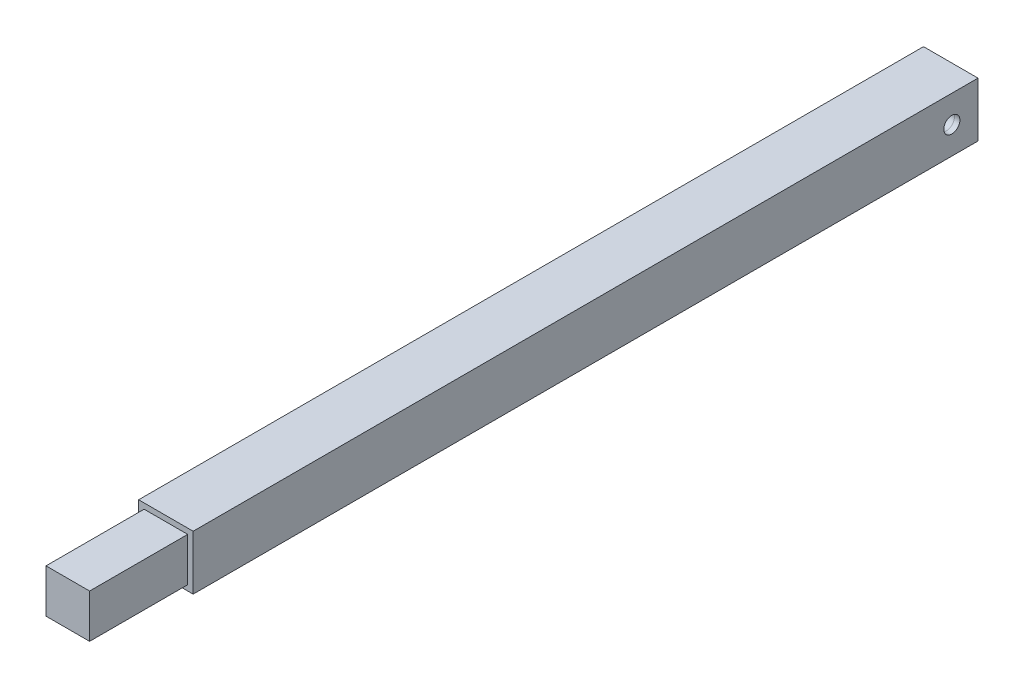
ISO-10303-21;
HEADER;
FILE_DESCRIPTION(('STEP AP214'),'2;1');
FILE_NAME('part.step','',(''),(''),'','','');
FILE_SCHEMA(('AUTOMOTIVE_DESIGN { 1 0 10303 214 1 1 1 1 }'));
ENDSEC;
DATA;
#1=APPLICATION_CONTEXT('core data for automotive mechanical design processes');
#2=APPLICATION_PROTOCOL_DEFINITION('international standard','automotive_design',2000,#1);
#3=PRODUCT_CONTEXT('',#1,'mechanical');
#4=PRODUCT('Part','Part','',(#3));
#5=PRODUCT_RELATED_PRODUCT_CATEGORY('part','',(#4));
#6=PRODUCT_DEFINITION_FORMATION('','',#4);
#7=PRODUCT_DEFINITION_CONTEXT('part definition',#1,'design');
#8=PRODUCT_DEFINITION('design','',#6,#7);
#9=PRODUCT_DEFINITION_SHAPE('','',#8);
#10=(LENGTH_UNIT() NAMED_UNIT(*) SI_UNIT(.MILLI.,.METRE.));
#11=(NAMED_UNIT(*) PLANE_ANGLE_UNIT() SI_UNIT($,.RADIAN.));
#12=(NAMED_UNIT(*) SI_UNIT($,.STERADIAN.) SOLID_ANGLE_UNIT());
#13=UNCERTAINTY_MEASURE_WITH_UNIT(LENGTH_MEASURE(1.E-05),#10,'distance_accuracy_value','');
#14=(GEOMETRIC_REPRESENTATION_CONTEXT(3) GLOBAL_UNCERTAINTY_ASSIGNED_CONTEXT((#13)) GLOBAL_UNIT_ASSIGNED_CONTEXT((#10,
#11,#12)) REPRESENTATION_CONTEXT('',''));
#15=CARTESIAN_POINT('',(0.,0.,0.));
#16=DIRECTION('',(0.,0.,1.));
#17=DIRECTION('',(1.,0.,0.));
#18=AXIS2_PLACEMENT_3D('',#15,#16,#17);
#19=CARTESIAN_POINT('',(12.7,12.7,31.75));
#20=DIRECTION('',(1.,0.,0.));
#21=DIRECTION('',(0.,0.,-1.));
#22=AXIS2_PLACEMENT_3D('',#19,#20,#21);
#23=PLANE('',#22);
#24=CARTESIAN_POINT('',(12.7,0.,15.24));
#25=DIRECTION('',(1.,0.,0.));
#26=DIRECTION('',(0.,0.,-1.));
#27=AXIS2_PLACEMENT_3D('',#24,#25,#26);
#28=CIRCLE('',#27,4.69900000000001);
#29=CARTESIAN_POINT('',(12.7,0.,10.541));
#30=VERTEX_POINT('',#29);
#31=EDGE_CURVE('E102',#30,#30,#28,.T.);
#32=ORIENTED_EDGE('',*,*,#31,.F.);
#33=EDGE_LOOP('',(#32));
#34=FACE_BOUND('',#33,.T.);
#35=DIRECTION('',(0.,-1.,0.));
#36=VECTOR('',#35,1.);
#37=CARTESIAN_POINT('',(12.7,12.7,0.));
#38=LINE('',#37,#36);
#39=CARTESIAN_POINT('',(12.7,12.7,0.));
#40=VERTEX_POINT('',#39);
#41=CARTESIAN_POINT('',(12.7,-12.7,0.));
#42=VERTEX_POINT('',#41);
#43=EDGE_CURVE('E83',#40,#42,#38,.T.);
#44=ORIENTED_EDGE('',*,*,#43,.F.);
#45=DIRECTION('',(0.,0.,-1.));
#46=VECTOR('',#45,1.);
#47=CARTESIAN_POINT('',(12.7,12.7,31.75));
#48=LINE('',#47,#46);
#49=CARTESIAN_POINT('',(12.7,12.7,31.75));
#50=VERTEX_POINT('',#49);
#51=EDGE_CURVE('E12',#50,#40,#48,.T.);
#52=ORIENTED_EDGE('',*,*,#51,.F.);
#53=DIRECTION('',(0.,-1.,0.));
#54=VECTOR('',#53,1.);
#55=CARTESIAN_POINT('',(12.7,12.7,31.75));
#56=LINE('',#55,#54);
#57=CARTESIAN_POINT('',(12.7,-12.7,31.75));
#58=VERTEX_POINT('',#57);
#59=EDGE_CURVE('E85',#50,#58,#56,.T.);
#60=ORIENTED_EDGE('',*,*,#59,.T.);
#61=DIRECTION('',(0.,0.,-1.));
#62=VECTOR('',#61,1.);
#63=CARTESIAN_POINT('',(12.7,-12.7,31.75));
#64=LINE('',#63,#62);
#65=EDGE_CURVE('E80',#58,#42,#64,.T.);
#66=ORIENTED_EDGE('',*,*,#65,.T.);
#67=EDGE_LOOP('',(#44,#52,#60,#66));
#68=FACE_BOUND('',#67,.T.);
#69=ADVANCED_FACE('F38',(#34,#68),#23,.T.);
#70=CARTESIAN_POINT('',(12.7,12.7,31.75));
#71=DIRECTION('',(0.,1.,0.));
#72=DIRECTION('',(0.,0.,1.));
#73=AXIS2_PLACEMENT_3D('',#70,#71,#72);
#74=PLANE('',#73);
#75=DIRECTION('',(1.,0.,0.));
#76=VECTOR('',#75,1.);
#77=CARTESIAN_POINT('',(12.7,12.7,0.));
#78=LINE('',#77,#76);
#79=CARTESIAN_POINT('',(-12.7,12.7,0.));
#80=VERTEX_POINT('',#79);
#81=EDGE_CURVE('E101',#80,#40,#78,.T.);
#82=ORIENTED_EDGE('',*,*,#81,.F.);
#83=DIRECTION('',(0.,0.,-1.));
#84=VECTOR('',#83,1.);
#85=CARTESIAN_POINT('',(-12.7,12.7,31.75));
#86=LINE('',#85,#84);
#87=CARTESIAN_POINT('',(-12.7,12.7,31.75));
#88=VERTEX_POINT('',#87);
#89=EDGE_CURVE('E50',#88,#80,#86,.T.);
#90=ORIENTED_EDGE('',*,*,#89,.F.);
#91=DIRECTION('',(1.,0.,0.));
#92=VECTOR('',#91,1.);
#93=CARTESIAN_POINT('',(12.7,12.7,31.75));
#94=LINE('',#93,#92);
#95=EDGE_CURVE('E90',#88,#50,#94,.T.);
#96=ORIENTED_EDGE('',*,*,#95,.T.);
#97=ORIENTED_EDGE('',*,*,#51,.T.);
#98=EDGE_LOOP('',(#82,#90,#96,#97));
#99=FACE_BOUND('',#98,.T.);
#100=ADVANCED_FACE('F143',(#99),#74,.T.);
#101=CARTESIAN_POINT('',(-12.7,12.7,31.75));
#102=DIRECTION('',(-1.,0.,0.));
#103=DIRECTION('',(0.,0.,1.));
#104=AXIS2_PLACEMENT_3D('',#101,#102,#103);
#105=PLANE('',#104);
#106=CARTESIAN_POINT('',(-12.7,0.,15.24));
#107=DIRECTION('',(-1.,0.,0.));
#108=DIRECTION('',(0.,0.,1.));
#109=AXIS2_PLACEMENT_3D('',#106,#107,#108);
#110=CIRCLE('',#109,4.69900000000001);
#111=CARTESIAN_POINT('',(-12.7,0.,19.939));
#112=VERTEX_POINT('',#111);
#113=EDGE_CURVE('E105',#112,#112,#110,.T.);
#114=ORIENTED_EDGE('',*,*,#113,.F.);
#115=EDGE_LOOP('',(#114));
#116=FACE_BOUND('',#115,.T.);
#117=DIRECTION('',(0.,1.,0.));
#118=VECTOR('',#117,1.);
#119=CARTESIAN_POINT('',(-12.7,12.7,0.));
#120=LINE('',#119,#118);
#121=CARTESIAN_POINT('',(-12.7,-12.7,0.));
#122=VERTEX_POINT('',#121);
#123=EDGE_CURVE('E98',#122,#80,#120,.T.);
#124=ORIENTED_EDGE('',*,*,#123,.F.);
#125=DIRECTION('',(0.,0.,-1.));
#126=VECTOR('',#125,1.);
#127=CARTESIAN_POINT('',(-12.7,-12.7,31.75));
#128=LINE('',#127,#126);
#129=CARTESIAN_POINT('',(-12.7,-12.7,31.75));
#130=VERTEX_POINT('',#129);
#131=EDGE_CURVE('E89',#130,#122,#128,.T.);
#132=ORIENTED_EDGE('',*,*,#131,.F.);
#133=DIRECTION('',(0.,1.,0.));
#134=VECTOR('',#133,1.);
#135=CARTESIAN_POINT('',(-12.7,12.7,31.75));
#136=LINE('',#135,#134);
#137=EDGE_CURVE('E114',#130,#88,#136,.T.);
#138=ORIENTED_EDGE('',*,*,#137,.T.);
#139=ORIENTED_EDGE('',*,*,#89,.T.);
#140=EDGE_LOOP('',(#124,#132,#138,#139));
#141=FACE_BOUND('',#140,.T.);
#142=ADVANCED_FACE('F148',(#116,#141),#105,.T.);
#143=CARTESIAN_POINT('',(12.7,-12.7,31.75));
#144=DIRECTION('',(0.,-1.,0.));
#145=DIRECTION('',(0.,0.,-1.));
#146=AXIS2_PLACEMENT_3D('',#143,#144,#145);
#147=PLANE('',#146);
#148=DIRECTION('',(-1.,0.,0.));
#149=VECTOR('',#148,1.);
#150=CARTESIAN_POINT('',(12.7,-12.7,0.));
#151=LINE('',#150,#149);
#152=EDGE_CURVE('E93',#42,#122,#151,.T.);
#153=ORIENTED_EDGE('',*,*,#152,.F.);
#154=ORIENTED_EDGE('',*,*,#65,.F.);
#155=DIRECTION('',(-1.,0.,0.));
#156=VECTOR('',#155,1.);
#157=CARTESIAN_POINT('',(12.7,-12.7,31.75));
#158=LINE('',#157,#156);
#159=EDGE_CURVE('E112',#58,#130,#158,.T.);
#160=ORIENTED_EDGE('',*,*,#159,.T.);
#161=ORIENTED_EDGE('',*,*,#131,.T.);
#162=EDGE_LOOP('',(#153,#154,#160,#161));
#163=FACE_BOUND('',#162,.T.);
#164=ADVANCED_FACE('F94',(#163),#147,.T.);
#165=CARTESIAN_POINT('',(12.7,-12.7,31.75));
#166=DIRECTION('',(0.,0.,-1.));
#167=DIRECTION('',(-1.,0.,0.));
#168=AXIS2_PLACEMENT_3D('',#165,#166,#167);
#169=PLANE('',#168);
#170=ORIENTED_EDGE('',*,*,#59,.F.);
#171=ORIENTED_EDGE('',*,*,#95,.F.);
#172=ORIENTED_EDGE('',*,*,#137,.F.);
#173=ORIENTED_EDGE('',*,*,#159,.F.);
#174=EDGE_LOOP('',(#170,#171,#172,#173));
#175=FACE_BOUND('',#174,.T.);
#176=ADVANCED_FACE('F133',(#175),#169,.F.);
#177=CARTESIAN_POINT('',(12.7,-12.7,0.));
#178=DIRECTION('',(0.,0.,-1.));
#179=DIRECTION('',(-1.,0.,0.));
#180=AXIS2_PLACEMENT_3D('',#177,#178,#179);
#181=PLANE('',#180);
#182=CARTESIAN_POINT('',(0.,0.,0.));
#183=DIRECTION('',(0.,0.,-1.));
#184=DIRECTION('',(-1.,0.,0.));
#185=AXIS2_PLACEMENT_3D('',#182,#183,#184);
#186=CIRCLE('',#185,1.0795);
#187=CARTESIAN_POINT('',(-1.0795,0.,0.));
#188=VERTEX_POINT('',#187);
#189=EDGE_CURVE('E122',#188,#188,#186,.T.);
#190=ORIENTED_EDGE('',*,*,#189,.F.);
#191=EDGE_LOOP('',(#190));
#192=FACE_BOUND('',#191,.T.);
#193=ORIENTED_EDGE('',*,*,#43,.T.);
#194=ORIENTED_EDGE('',*,*,#152,.T.);
#195=ORIENTED_EDGE('',*,*,#123,.T.);
#196=ORIENTED_EDGE('',*,*,#81,.T.);
#197=EDGE_LOOP('',(#193,#194,#195,#196));
#198=FACE_BOUND('',#197,.T.);
#199=ADVANCED_FACE('F100',(#192,#198),#181,.T.);
#200=CARTESIAN_POINT('',(15.875,0.,15.24));
#201=DIRECTION('',(-1.,0.,0.));
#202=DIRECTION('',(0.,-1.,0.));
#203=AXIS2_PLACEMENT_3D('',#200,#201,#202);
#204=CYLINDRICAL_SURFACE('',#203,4.69900000000001);
#205=CARTESIAN_POINT('',(-1.0795,0.,10.541));
#206=CARTESIAN_POINT('',(-1.07949807016135,0.0597946335129183,10.5410010854249));
#207=CARTESIAN_POINT('',(-1.07451511194974,0.119611958420805,10.5421528500373));
#208=CARTESIAN_POINT('',(-1.05473870438552,0.237542337276588,10.5466361088343));
#209=CARTESIAN_POINT('',(-1.03993873527837,0.295654231798842,10.5499690515813));
#210=CARTESIAN_POINT('',(-1.00102041634723,0.408452824224982,10.5584442495751));
#211=CARTESIAN_POINT('',(-0.976912298129916,0.463143206650998,10.5635845176401));
#212=CARTESIAN_POINT('',(-0.920095716500838,0.567701879877367,10.5751220811394));
#213=CARTESIAN_POINT('',(-0.887387298894656,0.61757019635833,10.5815193698786));
#214=CARTESIAN_POINT('',(-0.813689970241831,0.711947760037916,10.5949981285842));
#215=CARTESIAN_POINT('',(-0.7725785520188,0.756360037208844,10.6020888009976));
#216=CARTESIAN_POINT('',(-0.683504986122872,0.837723313825225,10.6160916006706));
#217=CARTESIAN_POINT('',(-0.635542176674155,0.874673591683093,10.6230037106066));
#218=CARTESIAN_POINT('',(-0.533398205664876,0.940501307323812,10.6359581509268));
#219=CARTESIAN_POINT('',(-0.479147751345274,0.969273746066855,10.6419887242187));
#220=CARTESIAN_POINT('',(-0.366419933041075,1.01725495784486,10.6523644442639));
#221=CARTESIAN_POINT('',(-0.307943132113822,1.03646500215529,10.65670981504));
#222=CARTESIAN_POINT('',(-0.189479492331677,1.0644521393944,10.6631290971366));
#223=CARTESIAN_POINT('',(-0.129535511959579,1.07340184481896,10.6652405420512));
#224=CARTESIAN_POINT('',(-0.00896260096932679,1.08115130444179,10.6670655003057));
#225=CARTESIAN_POINT('',(0.0516662352855059,1.07995244033467,10.6667793400717));
#226=CARTESIAN_POINT('',(0.170591442057388,1.0675772972818,10.663875320831));
#227=CARTESIAN_POINT('',(0.228910187068952,1.05660324845799,10.6613047249843));
#228=CARTESIAN_POINT('',(0.342856038627512,1.02531038645457,10.6541964003699));
#229=CARTESIAN_POINT('',(0.398482980053871,1.00499100081431,10.6496585510964));
#230=CARTESIAN_POINT('',(0.506025795633166,0.955403129363283,10.6390815328818));
#231=CARTESIAN_POINT('',(0.55790519711361,0.926058368477275,10.6330296532306));
#232=CARTESIAN_POINT('',(0.656077557167469,0.859306264486391,10.6201140496417));
#233=CARTESIAN_POINT('',(0.702369678793361,0.821897715797463,10.6132502043797));
#234=CARTESIAN_POINT('',(0.789215967419893,0.739017158895719,10.5992825282678));
#235=CARTESIAN_POINT('',(0.829606314525455,0.693373612575394,10.5921768851274));
#236=CARTESIAN_POINT('',(0.90218747080879,0.595878606766907,10.5786753173793));
#237=CARTESIAN_POINT('',(0.934378100196464,0.544027011195358,10.5722794083351));
#238=CARTESIAN_POINT('',(0.989693062576594,0.435376470688608,10.560893706596));
#239=CARTESIAN_POINT('',(1.01279420044592,0.378565314794782,10.5559075203177));
#240=CARTESIAN_POINT('',(1.04907551811023,0.261727012315223,10.5479296324455));
#241=CARTESIAN_POINT('',(1.06225729307277,0.201700384484641,10.544937610172));
#242=CARTESIAN_POINT('',(1.07808342404734,0.0815387070693773,10.5413314289122));
#243=CARTESIAN_POINT('',(1.08095131765174,0.0214345717662375,10.5406668349524));
#244=CARTESIAN_POINT('',(1.07667659835923,-0.0983941463941838,10.5416482786532));
#245=CARTESIAN_POINT('',(1.06953473849777,-0.1581187574636,10.5432941424979));
#246=CARTESIAN_POINT('',(1.04562828837279,-0.274740208156289,10.5486795708699));
#247=CARTESIAN_POINT('',(1.02898253574809,-0.331662709874806,10.5523932650924));
#248=CARTESIAN_POINT('',(0.986674006365106,-0.441906746862809,10.5614979219219));
#249=CARTESIAN_POINT('',(0.961010409131734,-0.495227953947437,10.5668890371415));
#250=CARTESIAN_POINT('',(0.900940001503749,-0.597668430097949,10.5788738643049));
#251=CARTESIAN_POINT('',(0.86640392915468,-0.646709826595158,10.5854849092737));
#252=CARTESIAN_POINT('',(0.789737411208899,-0.738381094976859,10.5991438156865));
#253=CARTESIAN_POINT('',(0.747605870232371,-0.781010040461574,10.6061917400388));
#254=CARTESIAN_POINT('',(0.655914103207825,-0.859542960930743,10.620106803407));
#255=CARTESIAN_POINT('',(0.606219459274292,-0.895291403402771,10.6269672879682));
#256=CARTESIAN_POINT('',(0.501401543559561,-0.957937323478652,10.6395671703285));
#257=CARTESIAN_POINT('',(0.446278512935771,-0.984835194041065,10.6453066178961));
#258=CARTESIAN_POINT('',(0.332469011914495,-1.02882650296482,10.6549564279752));
#259=CARTESIAN_POINT('',(0.273805460608323,-1.04597679704227,10.6588773722506));
#260=CARTESIAN_POINT('',(0.154326280292343,-1.07014801330307,10.6644627672945));
#261=CARTESIAN_POINT('',(0.0935110388433115,-1.07717075023376,10.6661276223263));
#262=CARTESIAN_POINT('',(-0.0269724029420397,-1.08080416651148,10.666985021936));
#263=CARTESIAN_POINT('',(-0.086632860331647,-1.0776620614778,10.6662362686448));
#264=CARTESIAN_POINT('',(-0.204549422024232,-1.06161208608916,10.6624845785605));
#265=CARTESIAN_POINT('',(-0.262805546533999,-1.04870435633732,10.6594816742222));
#266=CARTESIAN_POINT('',(-0.376038939071281,-1.01361443064127,10.6515900757738));
#267=CARTESIAN_POINT('',(-0.431029045683041,-0.991471735020219,10.6467094201009));
#268=CARTESIAN_POINT('',(-0.53654927235998,-0.938573134586268,10.635609850266));
#269=CARTESIAN_POINT('',(-0.587078872788046,-0.907816227977692,10.6293907804717));
#270=CARTESIAN_POINT('',(-0.683454430878413,-0.837757555493837,10.6161424442465));
#271=CARTESIAN_POINT('',(-0.729171403316906,-0.798281142815984,10.6090982483371));
#272=CARTESIAN_POINT('',(-0.813412825436993,-0.712253496777235,10.5950897063015));
#273=CARTESIAN_POINT('',(-0.851935598532188,-0.665700618841336,10.5881253791427));
#274=CARTESIAN_POINT('',(-0.921238695044823,-0.566019603615741,10.5749400528976));
#275=CARTESIAN_POINT('',(-0.951897432922455,-0.512805194231345,10.5687314266073));
#276=CARTESIAN_POINT('',(-1.00378587886775,-0.401844351754072,10.557883077879));
#277=CARTESIAN_POINT('',(-1.02502311358197,-0.344101579835907,10.5532421037855));
#278=CARTESIAN_POINT('',(-1.05389121793561,-0.238626306112401,10.5468328336875));
#279=CARTESIAN_POINT('',(-1.06347539452255,-0.191443255029653,10.5446595555898));
#280=CARTESIAN_POINT('',(-1.07628039138934,-0.0961783308893717,10.5417427404747));
#281=CARTESIAN_POINT('',(-1.07950155228808,-0.0480965060832366,10.5409991269259));
#282=CARTESIAN_POINT('',(-1.0795,0.,10.541));
#283=B_SPLINE_CURVE_WITH_KNOTS('',3,(#205,#206,#207,#208,#209,#210,#211,#212,#213,#214,#215,
#216,#217,#218,#219,#220,#221,#222,#223,#224,#225,#226,#227,#228,#229,#230,#231,#232,#233,#234,
#235,#236,#237,#238,#239,#240,#241,#242,#243,#244,#245,#246,#247,#248,#249,#250,#251,#252,#253,
#254,#255,#256,#257,#258,#259,#260,#261,#262,#263,#264,#265,#266,#267,#268,#269,#270,#271,#272,
#273,#274,#275,#276,#277,#278,#279,#280,#281,#282),.UNSPECIFIED.,.T.,.F.,(4,2,2,2,2,2,2,2,2,2,2,
2,2,2,2,2,2,2,2,2,2,2,2,2,2,2,2,2,2,2,2,2,2,2,2,2,2,2,4),(0.,0.179207781191039,
0.358534698660149,0.537665056885173,0.716794461073078,0.898750172885034,1.08072347169642,
1.26493732932696,1.44912669004452,1.63016968646746,1.8111880348741,1.98854625293696,
2.16591533675333,2.34482662115337,2.52376467242519,2.70698474936517,2.89020884331184,
3.07389751351811,3.25755663778854,3.43721040100187,3.61685064955765,3.79429236838816,
3.97175023566971,4.15195664195868,4.33218905751794,4.51611104228275,4.70002485995124,
4.88285463521859,5.06565164531966,5.2440366437698,5.42241907392425,5.60004621690922,
5.77769402575038,5.95928831726295,6.14092487610861,6.32522017452134,6.50936797688165,
6.65352354850175,6.79767140311408),.UNSPECIFIED.);
#284=CARTESIAN_POINT('',(-1.0795,0.,10.541));
#285=VERTEX_POINT('',#284);
#286=EDGE_CURVE('E41',#285,#285,#283,.T.);
#287=ORIENTED_EDGE('',*,*,#286,.T.);
#288=EDGE_LOOP('',(#287));
#289=FACE_BOUND('',#288,.T.);
#290=ORIENTED_EDGE('',*,*,#31,.T.);
#291=EDGE_LOOP('',(#290));
#292=FACE_BOUND('',#291,.T.);
#293=ORIENTED_EDGE('',*,*,#113,.T.);
#294=EDGE_LOOP('',(#293));
#295=FACE_BOUND('',#294,.T.);
#296=ADVANCED_FACE('F132',(#289,#292,#295),#204,.F.);
#297=CARTESIAN_POINT('',(0.,0.,15.24));
#298=DIRECTION('',(0.,0.,-1.));
#299=DIRECTION('',(-1.,0.,0.));
#300=AXIS2_PLACEMENT_3D('',#297,#298,#299);
#301=CYLINDRICAL_SURFACE('',#300,1.0795);
#302=ORIENTED_EDGE('',*,*,#189,.T.);
#303=EDGE_LOOP('',(#302));
#304=FACE_BOUND('',#303,.T.);
#305=ORIENTED_EDGE('',*,*,#286,.F.);
#306=EDGE_LOOP('',(#305));
#307=FACE_BOUND('',#306,.T.);
#308=ADVANCED_FACE('F128',(#304,#307),#301,.F.);
#309=CLOSED_SHELL('',(#69,#100,#142,#164,#176,#199,#296,#308));
#310=MANIFOLD_SOLID_BREP('B2',#309);
#311=CARTESIAN_POINT('',(-12.7,12.7,514.35));
#312=DIRECTION('',(1.,0.,0.));
#313=DIRECTION('',(0.,0.,-1.));
#314=AXIS2_PLACEMENT_3D('',#311,#312,#313);
#315=PLANE('',#314);
#316=DIRECTION('',(0.,-1.,0.));
#317=VECTOR('',#316,1.);
#318=CARTESIAN_POINT('',(-12.7,12.7,457.2));
#319=LINE('',#318,#317);
#320=CARTESIAN_POINT('',(-12.7,12.7,457.2));
#321=VERTEX_POINT('',#320);
#322=CARTESIAN_POINT('',(-12.7,-12.7,457.2));
#323=VERTEX_POINT('',#322);
#324=EDGE_CURVE('E244',#321,#323,#319,.T.);
#325=ORIENTED_EDGE('',*,*,#324,.T.);
#326=DIRECTION('',(0.,0.,-1.));
#327=VECTOR('',#326,1.);
#328=CARTESIAN_POINT('',(-12.7,-12.7,514.35));
#329=LINE('',#328,#327);
#330=CARTESIAN_POINT('',(-12.7,-12.7,514.35));
#331=VERTEX_POINT('',#330);
#332=EDGE_CURVE('E36',#331,#323,#329,.T.);
#333=ORIENTED_EDGE('',*,*,#332,.F.);
#334=DIRECTION('',(0.,-1.,0.));
#335=VECTOR('',#334,1.);
#336=CARTESIAN_POINT('',(-12.7,12.7,514.35));
#337=LINE('',#336,#335);
#338=CARTESIAN_POINT('',(-12.7,12.7,514.35));
#339=VERTEX_POINT('',#338);
#340=EDGE_CURVE('E262',#339,#331,#337,.T.);
#341=ORIENTED_EDGE('',*,*,#340,.F.);
#342=DIRECTION('',(0.,0.,-1.));
#343=VECTOR('',#342,1.);
#344=CARTESIAN_POINT('',(-12.7,12.7,514.35));
#345=LINE('',#344,#343);
#346=EDGE_CURVE('E256',#339,#321,#345,.T.);
#347=ORIENTED_EDGE('',*,*,#346,.T.);
#348=EDGE_LOOP('',(#325,#333,#341,#347));
#349=FACE_BOUND('',#348,.T.);
#350=ADVANCED_FACE('F200',(#349),#315,.F.);
#351=CARTESIAN_POINT('',(-12.7,-12.7,514.35));
#352=DIRECTION('',(0.,1.,0.));
#353=DIRECTION('',(0.,0.,1.));
#354=AXIS2_PLACEMENT_3D('',#351,#352,#353);
#355=PLANE('',#354);
#356=DIRECTION('',(1.,0.,0.));
#357=VECTOR('',#356,1.);
#358=CARTESIAN_POINT('',(-12.7,-12.7,457.2));
#359=LINE('',#358,#357);
#360=CARTESIAN_POINT('',(12.7,-12.7,457.2));
#361=VERTEX_POINT('',#360);
#362=EDGE_CURVE('E240',#323,#361,#359,.T.);
#363=ORIENTED_EDGE('',*,*,#362,.T.);
#364=DIRECTION('',(0.,0.,-1.));
#365=VECTOR('',#364,1.);
#366=CARTESIAN_POINT('',(12.7,-12.7,514.35));
#367=LINE('',#366,#365);
#368=CARTESIAN_POINT('',(12.7,-12.7,514.35));
#369=VERTEX_POINT('',#368);
#370=EDGE_CURVE('E207',#369,#361,#367,.T.);
#371=ORIENTED_EDGE('',*,*,#370,.F.);
#372=DIRECTION('',(1.,0.,0.));
#373=VECTOR('',#372,1.);
#374=CARTESIAN_POINT('',(-12.7,-12.7,514.35));
#375=LINE('',#374,#373);
#376=EDGE_CURVE('E252',#331,#369,#375,.T.);
#377=ORIENTED_EDGE('',*,*,#376,.F.);
#378=ORIENTED_EDGE('',*,*,#332,.T.);
#379=EDGE_LOOP('',(#363,#371,#377,#378));
#380=FACE_BOUND('',#379,.T.);
#381=ADVANCED_FACE('F251',(#380),#355,.F.);
#382=CARTESIAN_POINT('',(12.7,12.7,514.35));
#383=DIRECTION('',(-1.,0.,0.));
#384=DIRECTION('',(0.,0.,1.));
#385=AXIS2_PLACEMENT_3D('',#382,#383,#384);
#386=PLANE('',#385);
#387=DIRECTION('',(0.,1.,0.));
#388=VECTOR('',#387,1.);
#389=CARTESIAN_POINT('',(12.7,12.7,457.2));
#390=LINE('',#389,#388);
#391=CARTESIAN_POINT('',(12.7,12.7,457.2));
#392=VERTEX_POINT('',#391);
#393=EDGE_CURVE('E245',#361,#392,#390,.T.);
#394=ORIENTED_EDGE('',*,*,#393,.T.);
#395=DIRECTION('',(0.,0.,-1.));
#396=VECTOR('',#395,1.);
#397=CARTESIAN_POINT('',(12.7,12.7,514.35));
#398=LINE('',#397,#396);
#399=CARTESIAN_POINT('',(12.7,12.7,514.35));
#400=VERTEX_POINT('',#399);
#401=EDGE_CURVE('E268',#400,#392,#398,.T.);
#402=ORIENTED_EDGE('',*,*,#401,.F.);
#403=DIRECTION('',(0.,1.,0.));
#404=VECTOR('',#403,1.);
#405=CARTESIAN_POINT('',(12.7,12.7,514.35));
#406=LINE('',#405,#404);
#407=EDGE_CURVE('E219',#369,#400,#406,.T.);
#408=ORIENTED_EDGE('',*,*,#407,.F.);
#409=ORIENTED_EDGE('',*,*,#370,.T.);
#410=EDGE_LOOP('',(#394,#402,#408,#409));
#411=FACE_BOUND('',#410,.T.);
#412=ADVANCED_FACE('F271',(#411),#386,.F.);
#413=CARTESIAN_POINT('',(-12.7,12.7,514.35));
#414=DIRECTION('',(0.,-1.,0.));
#415=DIRECTION('',(0.,0.,-1.));
#416=AXIS2_PLACEMENT_3D('',#413,#414,#415);
#417=PLANE('',#416);
#418=DIRECTION('',(-1.,0.,0.));
#419=VECTOR('',#418,1.);
#420=CARTESIAN_POINT('',(-12.7,12.7,457.2));
#421=LINE('',#420,#419);
#422=EDGE_CURVE('E260',#392,#321,#421,.T.);
#423=ORIENTED_EDGE('',*,*,#422,.T.);
#424=ORIENTED_EDGE('',*,*,#346,.F.);
#425=DIRECTION('',(-1.,0.,0.));
#426=VECTOR('',#425,1.);
#427=CARTESIAN_POINT('',(-12.7,12.7,514.35));
#428=LINE('',#427,#426);
#429=EDGE_CURVE('E214',#400,#339,#428,.T.);
#430=ORIENTED_EDGE('',*,*,#429,.F.);
#431=ORIENTED_EDGE('',*,*,#401,.T.);
#432=EDGE_LOOP('',(#423,#424,#430,#431));
#433=FACE_BOUND('',#432,.T.);
#434=ADVANCED_FACE('F273',(#433),#417,.F.);
#435=CARTESIAN_POINT('',(-12.7,-12.7,514.35));
#436=DIRECTION('',(0.,0.,1.));
#437=DIRECTION('',(1.,0.,0.));
#438=AXIS2_PLACEMENT_3D('',#435,#436,#437);
#439=PLANE('',#438);
#440=ORIENTED_EDGE('',*,*,#340,.T.);
#441=ORIENTED_EDGE('',*,*,#376,.T.);
#442=ORIENTED_EDGE('',*,*,#407,.T.);
#443=ORIENTED_EDGE('',*,*,#429,.T.);
#444=EDGE_LOOP('',(#440,#441,#442,#443));
#445=FACE_BOUND('',#444,.T.);
#446=ADVANCED_FACE('F274',(#445),#439,.T.);
#447=CARTESIAN_POINT('',(-12.7,-12.7,457.2));
#448=DIRECTION('',(0.,0.,1.));
#449=DIRECTION('',(1.,0.,0.));
#450=AXIS2_PLACEMENT_3D('',#447,#448,#449);
#451=PLANE('',#450);
#452=ORIENTED_EDGE('',*,*,#324,.F.);
#453=ORIENTED_EDGE('',*,*,#422,.F.);
#454=ORIENTED_EDGE('',*,*,#393,.F.);
#455=ORIENTED_EDGE('',*,*,#362,.F.);
#456=EDGE_LOOP('',(#452,#453,#454,#455));
#457=FACE_BOUND('',#456,.T.);
#458=ADVANCED_FACE('F241',(#457),#451,.F.);
#459=CLOSED_SHELL('',(#350,#381,#412,#434,#446,#458));
#460=MANIFOLD_SOLID_BREP('B6',#459);
#461=CARTESIAN_POINT('',(-15.875,-15.875,457.2));
#462=DIRECTION('',(0.,0.,1.));
#463=DIRECTION('',(1.,0.,0.));
#464=AXIS2_PLACEMENT_3D('',#461,#462,#463);
#465=PLANE('',#464);
#466=DIRECTION('',(0.,-1.,0.));
#467=VECTOR('',#466,1.);
#468=CARTESIAN_POINT('',(-15.875,15.875,457.2));
#469=LINE('',#468,#467);
#470=CARTESIAN_POINT('',(-15.875,15.875,457.2));
#471=VERTEX_POINT('',#470);
#472=CARTESIAN_POINT('',(-15.875,-15.875,457.2));
#473=VERTEX_POINT('',#472);
#474=EDGE_CURVE('E425',#471,#473,#469,.T.);
#475=ORIENTED_EDGE('',*,*,#474,.T.);
#476=DIRECTION('',(1.,0.,0.));
#477=VECTOR('',#476,1.);
#478=CARTESIAN_POINT('',(-15.875,-15.875,457.2));
#479=LINE('',#478,#477);
#480=CARTESIAN_POINT('',(15.875,-15.875,457.2));
#481=VERTEX_POINT('',#480);
#482=EDGE_CURVE('E428',#473,#481,#479,.T.);
#483=ORIENTED_EDGE('',*,*,#482,.T.);
#484=DIRECTION('',(0.,1.,0.));
#485=VECTOR('',#484,1.);
#486=CARTESIAN_POINT('',(15.875,15.875,457.2));
#487=LINE('',#486,#485);
#488=CARTESIAN_POINT('',(15.875,15.875,457.2));
#489=VERTEX_POINT('',#488);
#490=EDGE_CURVE('E430',#481,#489,#487,.T.);
#491=ORIENTED_EDGE('',*,*,#490,.T.);
#492=DIRECTION('',(-1.,0.,0.));
#493=VECTOR('',#492,1.);
#494=CARTESIAN_POINT('',(-15.875,15.875,457.2));
#495=LINE('',#494,#493);
#496=EDGE_CURVE('E432',#489,#471,#495,.T.);
#497=ORIENTED_EDGE('',*,*,#496,.T.);
#498=EDGE_LOOP('',(#475,#483,#491,#497));
#499=FACE_BOUND('',#498,.T.);
#500=DIRECTION('',(1.,0.,0.));
#501=VECTOR('',#500,1.);
#502=CARTESIAN_POINT('',(-12.7,-12.7,457.2));
#503=LINE('',#502,#501);
#504=CARTESIAN_POINT('',(-12.7,-12.7,457.2));
#505=VERTEX_POINT('',#504);
#506=CARTESIAN_POINT('',(12.7,-12.7,457.2));
#507=VERTEX_POINT('',#506);
#508=EDGE_CURVE('E407',#505,#507,#503,.T.);
#509=ORIENTED_EDGE('',*,*,#508,.F.);
#510=DIRECTION('',(0.,-1.,0.));
#511=VECTOR('',#510,1.);
#512=CARTESIAN_POINT('',(-12.7,12.7,457.2));
#513=LINE('',#512,#511);
#514=CARTESIAN_POINT('',(-12.7,12.7,457.2));
#515=VERTEX_POINT('',#514);
#516=EDGE_CURVE('E392',#515,#505,#513,.T.);
#517=ORIENTED_EDGE('',*,*,#516,.F.);
#518=DIRECTION('',(-1.,0.,0.));
#519=VECTOR('',#518,1.);
#520=CARTESIAN_POINT('',(-12.7,12.7,457.2));
#521=LINE('',#520,#519);
#522=CARTESIAN_POINT('',(12.7,12.7,457.2));
#523=VERTEX_POINT('',#522);
#524=EDGE_CURVE('E411',#523,#515,#521,.T.);
#525=ORIENTED_EDGE('',*,*,#524,.F.);
#526=DIRECTION('',(0.,1.,0.));
#527=VECTOR('',#526,1.);
#528=CARTESIAN_POINT('',(12.7,12.7,457.2));
#529=LINE('',#528,#527);
#530=EDGE_CURVE('E409',#507,#523,#529,.T.);
#531=ORIENTED_EDGE('',*,*,#530,.F.);
#532=EDGE_LOOP('',(#509,#517,#525,#531));
#533=FACE_BOUND('',#532,.T.);
#534=ADVANCED_FACE('F311',(#499,#533),#465,.T.);
#535=CARTESIAN_POINT('',(-15.875,-15.875,0.));
#536=DIRECTION('',(0.,0.,1.));
#537=DIRECTION('',(1.,0.,0.));
#538=AXIS2_PLACEMENT_3D('',#535,#536,#537);
#539=PLANE('',#538);
#540=DIRECTION('',(0.,-1.,0.));
#541=VECTOR('',#540,1.);
#542=CARTESIAN_POINT('',(-15.875,15.875,0.));
#543=LINE('',#542,#541);
#544=CARTESIAN_POINT('',(-15.875,15.875,0.));
#545=VERTEX_POINT('',#544);
#546=CARTESIAN_POINT('',(-15.875,-15.875,0.));
#547=VERTEX_POINT('',#546);
#548=EDGE_CURVE('E393',#545,#547,#543,.T.);
#549=ORIENTED_EDGE('',*,*,#548,.F.);
#550=DIRECTION('',(-1.,0.,0.));
#551=VECTOR('',#550,1.);
#552=CARTESIAN_POINT('',(-15.875,15.875,0.));
#553=LINE('',#552,#551);
#554=CARTESIAN_POINT('',(15.875,15.875,0.));
#555=VERTEX_POINT('',#554);
#556=EDGE_CURVE('E423',#555,#545,#553,.T.);
#557=ORIENTED_EDGE('',*,*,#556,.F.);
#558=DIRECTION('',(0.,1.,0.));
#559=VECTOR('',#558,1.);
#560=CARTESIAN_POINT('',(15.875,15.875,0.));
#561=LINE('',#560,#559);
#562=CARTESIAN_POINT('',(15.875,-15.875,0.));
#563=VERTEX_POINT('',#562);
#564=EDGE_CURVE('E421',#563,#555,#561,.T.);
#565=ORIENTED_EDGE('',*,*,#564,.F.);
#566=DIRECTION('',(1.,0.,0.));
#567=VECTOR('',#566,1.);
#568=CARTESIAN_POINT('',(-15.875,-15.875,0.));
#569=LINE('',#568,#567);
#570=EDGE_CURVE('E419',#547,#563,#569,.T.);
#571=ORIENTED_EDGE('',*,*,#570,.F.);
#572=EDGE_LOOP('',(#549,#557,#565,#571));
#573=FACE_BOUND('',#572,.T.);
#574=DIRECTION('',(0.,-1.,0.));
#575=VECTOR('',#574,1.);
#576=CARTESIAN_POINT('',(-12.7,12.7,0.));
#577=LINE('',#576,#575);
#578=CARTESIAN_POINT('',(-12.7,12.7,0.));
#579=VERTEX_POINT('',#578);
#580=CARTESIAN_POINT('',(-12.7,-12.7,0.));
#581=VERTEX_POINT('',#580);
#582=EDGE_CURVE('E335',#579,#581,#577,.T.);
#583=ORIENTED_EDGE('',*,*,#582,.T.);
#584=DIRECTION('',(1.,0.,0.));
#585=VECTOR('',#584,1.);
#586=CARTESIAN_POINT('',(-12.7,-12.7,0.));
#587=LINE('',#586,#585);
#588=CARTESIAN_POINT('',(12.7,-12.7,0.));
#589=VERTEX_POINT('',#588);
#590=EDGE_CURVE('E379',#581,#589,#587,.T.);
#591=ORIENTED_EDGE('',*,*,#590,.T.);
#592=DIRECTION('',(0.,1.,0.));
#593=VECTOR('',#592,1.);
#594=CARTESIAN_POINT('',(12.7,12.7,0.));
#595=LINE('',#594,#593);
#596=CARTESIAN_POINT('',(12.7,12.7,0.));
#597=VERTEX_POINT('',#596);
#598=EDGE_CURVE('E388',#589,#597,#595,.T.);
#599=ORIENTED_EDGE('',*,*,#598,.T.);
#600=DIRECTION('',(-1.,0.,0.));
#601=VECTOR('',#600,1.);
#602=CARTESIAN_POINT('',(-12.7,12.7,0.));
#603=LINE('',#602,#601);
#604=EDGE_CURVE('E397',#597,#579,#603,.T.);
#605=ORIENTED_EDGE('',*,*,#604,.T.);
#606=EDGE_LOOP('',(#583,#591,#599,#605));
#607=FACE_BOUND('',#606,.T.);
#608=ADVANCED_FACE('F396',(#573,#607),#539,.F.);
#609=CARTESIAN_POINT('',(-15.875,15.875,457.2));
#610=DIRECTION('',(1.,0.,0.));
#611=DIRECTION('',(0.,1.,0.));
#612=AXIS2_PLACEMENT_3D('',#609,#610,#611);
#613=PLANE('',#612);
#614=CARTESIAN_POINT('',(-15.875,0.,15.24));
#615=DIRECTION('',(-1.,0.,0.));
#616=DIRECTION('',(0.,-1.,0.));
#617=AXIS2_PLACEMENT_3D('',#614,#615,#616);
#618=CIRCLE('',#617,4.69900000000001);
#619=CARTESIAN_POINT('',(-15.875,-4.69900000000001,15.24));
#620=VERTEX_POINT('',#619);
#621=EDGE_CURVE('E509',#620,#620,#618,.T.);
#622=ORIENTED_EDGE('',*,*,#621,.F.);
#623=EDGE_LOOP('',(#622));
#624=FACE_BOUND('',#623,.T.);
#625=ORIENTED_EDGE('',*,*,#548,.T.);
#626=DIRECTION('',(0.,0.,-1.));
#627=VECTOR('',#626,1.);
#628=CARTESIAN_POINT('',(-15.875,-15.875,457.2));
#629=LINE('',#628,#627);
#630=EDGE_CURVE('E198',#473,#547,#629,.T.);
#631=ORIENTED_EDGE('',*,*,#630,.F.);
#632=ORIENTED_EDGE('',*,*,#474,.F.);
#633=DIRECTION('',(0.,0.,-1.));
#634=VECTOR('',#633,1.);
#635=CARTESIAN_POINT('',(-15.875,15.875,457.2));
#636=LINE('',#635,#634);
#637=EDGE_CURVE('E434',#471,#545,#636,.T.);
#638=ORIENTED_EDGE('',*,*,#637,.T.);
#639=EDGE_LOOP('',(#625,#631,#632,#638));
#640=FACE_BOUND('',#639,.T.);
#641=ADVANCED_FACE('F313',(#624,#640),#613,.F.);
#642=CARTESIAN_POINT('',(-15.875,-15.875,457.2));
#643=DIRECTION('',(0.,1.,0.));
#644=DIRECTION('',(0.,0.,1.));
#645=AXIS2_PLACEMENT_3D('',#642,#643,#644);
#646=PLANE('',#645);
#647=ORIENTED_EDGE('',*,*,#570,.T.);
#648=DIRECTION('',(0.,0.,-1.));
#649=VECTOR('',#648,1.);
#650=CARTESIAN_POINT('',(15.875,-15.875,457.2));
#651=LINE('',#650,#649);
#652=EDGE_CURVE('E320',#481,#563,#651,.T.);
#653=ORIENTED_EDGE('',*,*,#652,.F.);
#654=ORIENTED_EDGE('',*,*,#482,.F.);
#655=ORIENTED_EDGE('',*,*,#630,.T.);
#656=EDGE_LOOP('',(#647,#653,#654,#655));
#657=FACE_BOUND('',#656,.T.);
#658=ADVANCED_FACE('F460',(#657),#646,.F.);
#659=CARTESIAN_POINT('',(15.875,15.875,457.2));
#660=DIRECTION('',(-1.,0.,0.));
#661=DIRECTION('',(0.,0.,1.));
#662=AXIS2_PLACEMENT_3D('',#659,#660,#661);
#663=PLANE('',#662);
#664=CARTESIAN_POINT('',(15.875,0.,15.24));
#665=DIRECTION('',(-1.,0.,0.));
#666=DIRECTION('',(0.,-1.,0.));
#667=AXIS2_PLACEMENT_3D('',#664,#665,#666);
#668=CIRCLE('',#667,4.69900000000001);
#669=CARTESIAN_POINT('',(15.875,-4.69900000000001,15.24));
#670=VERTEX_POINT('',#669);
#671=EDGE_CURVE('E508',#670,#670,#668,.T.);
#672=ORIENTED_EDGE('',*,*,#671,.T.);
#673=EDGE_LOOP('',(#672));
#674=FACE_BOUND('',#673,.T.);
#675=ORIENTED_EDGE('',*,*,#564,.T.);
#676=DIRECTION('',(0.,0.,-1.));
#677=VECTOR('',#676,1.);
#678=CARTESIAN_POINT('',(15.875,15.875,457.2));
#679=LINE('',#678,#677);
#680=EDGE_CURVE('E437',#489,#555,#679,.T.);
#681=ORIENTED_EDGE('',*,*,#680,.F.);
#682=ORIENTED_EDGE('',*,*,#490,.F.);
#683=ORIENTED_EDGE('',*,*,#652,.T.);
#684=EDGE_LOOP('',(#675,#681,#682,#683));
#685=FACE_BOUND('',#684,.T.);
#686=ADVANCED_FACE('F445',(#674,#685),#663,.F.);
#687=CARTESIAN_POINT('',(-15.875,15.875,457.2));
#688=DIRECTION('',(0.,-1.,0.));
#689=DIRECTION('',(0.,0.,-1.));
#690=AXIS2_PLACEMENT_3D('',#687,#688,#689);
#691=PLANE('',#690);
#692=ORIENTED_EDGE('',*,*,#556,.T.);
#693=ORIENTED_EDGE('',*,*,#637,.F.);
#694=ORIENTED_EDGE('',*,*,#496,.F.);
#695=ORIENTED_EDGE('',*,*,#680,.T.);
#696=EDGE_LOOP('',(#692,#693,#694,#695));
#697=FACE_BOUND('',#696,.T.);
#698=ADVANCED_FACE('F453',(#697),#691,.F.);
#699=CARTESIAN_POINT('',(-12.7,12.7,457.2));
#700=DIRECTION('',(1.,0.,0.));
#701=DIRECTION('',(0.,0.,-1.));
#702=AXIS2_PLACEMENT_3D('',#699,#700,#701);
#703=PLANE('',#702);
#704=CARTESIAN_POINT('',(-12.7,0.,15.24));
#705=DIRECTION('',(1.,0.,0.));
#706=DIRECTION('',(0.,0.,-1.));
#707=AXIS2_PLACEMENT_3D('',#704,#705,#706);
#708=CIRCLE('',#707,4.69900000000001);
#709=CARTESIAN_POINT('',(-12.7,0.,10.541));
#710=VERTEX_POINT('',#709);
#711=EDGE_CURVE('E398',#710,#710,#708,.T.);
#712=ORIENTED_EDGE('',*,*,#711,.F.);
#713=EDGE_LOOP('',(#712));
#714=FACE_BOUND('',#713,.T.);
#715=ORIENTED_EDGE('',*,*,#582,.F.);
#716=DIRECTION('',(0.,0.,-1.));
#717=VECTOR('',#716,1.);
#718=CARTESIAN_POINT('',(-12.7,12.7,457.2));
#719=LINE('',#718,#717);
#720=EDGE_CURVE('E413',#515,#579,#719,.T.);
#721=ORIENTED_EDGE('',*,*,#720,.F.);
#722=ORIENTED_EDGE('',*,*,#516,.T.);
#723=DIRECTION('',(0.,0.,-1.));
#724=VECTOR('',#723,1.);
#725=CARTESIAN_POINT('',(-12.7,-12.7,457.2));
#726=LINE('',#725,#724);
#727=EDGE_CURVE('E381',#505,#581,#726,.T.);
#728=ORIENTED_EDGE('',*,*,#727,.T.);
#729=EDGE_LOOP('',(#715,#721,#722,#728));
#730=FACE_BOUND('',#729,.T.);
#731=ADVANCED_FACE('F390',(#714,#730),#703,.T.);
#732=CARTESIAN_POINT('',(-12.7,-12.7,457.2));
#733=DIRECTION('',(0.,1.,0.));
#734=DIRECTION('',(0.,0.,1.));
#735=AXIS2_PLACEMENT_3D('',#732,#733,#734);
#736=PLANE('',#735);
#737=ORIENTED_EDGE('',*,*,#590,.F.);
#738=ORIENTED_EDGE('',*,*,#727,.F.);
#739=ORIENTED_EDGE('',*,*,#508,.T.);
#740=DIRECTION('',(0.,0.,-1.));
#741=VECTOR('',#740,1.);
#742=CARTESIAN_POINT('',(12.7,-12.7,457.2));
#743=LINE('',#742,#741);
#744=EDGE_CURVE('E384',#507,#589,#743,.T.);
#745=ORIENTED_EDGE('',*,*,#744,.T.);
#746=EDGE_LOOP('',(#737,#738,#739,#745));
#747=FACE_BOUND('',#746,.T.);
#748=ADVANCED_FACE('F380',(#747),#736,.T.);
#749=CARTESIAN_POINT('',(12.7,12.7,457.2));
#750=DIRECTION('',(-1.,0.,0.));
#751=DIRECTION('',(0.,-1.,0.));
#752=AXIS2_PLACEMENT_3D('',#749,#750,#751);
#753=PLANE('',#752);
#754=CARTESIAN_POINT('',(12.7,0.,15.24));
#755=DIRECTION('',(-1.,0.,0.));
#756=DIRECTION('',(0.,-1.,0.));
#757=AXIS2_PLACEMENT_3D('',#754,#755,#756);
#758=CIRCLE('',#757,4.69900000000001);
#759=CARTESIAN_POINT('',(12.7,-4.69900000000001,15.24));
#760=VERTEX_POINT('',#759);
#761=EDGE_CURVE('E315',#760,#760,#758,.T.);
#762=ORIENTED_EDGE('',*,*,#761,.F.);
#763=EDGE_LOOP('',(#762));
#764=FACE_BOUND('',#763,.T.);
#765=ORIENTED_EDGE('',*,*,#598,.F.);
#766=ORIENTED_EDGE('',*,*,#744,.F.);
#767=ORIENTED_EDGE('',*,*,#530,.T.);
#768=DIRECTION('',(0.,0.,-1.));
#769=VECTOR('',#768,1.);
#770=CARTESIAN_POINT('',(12.7,12.7,457.2));
#771=LINE('',#770,#769);
#772=EDGE_CURVE('E327',#523,#597,#771,.T.);
#773=ORIENTED_EDGE('',*,*,#772,.T.);
#774=EDGE_LOOP('',(#765,#766,#767,#773));
#775=FACE_BOUND('',#774,.T.);
#776=ADVANCED_FACE('F486',(#764,#775),#753,.T.);
#777=CARTESIAN_POINT('',(-12.7,12.7,457.2));
#778=DIRECTION('',(0.,-1.,0.));
#779=DIRECTION('',(0.,0.,-1.));
#780=AXIS2_PLACEMENT_3D('',#777,#778,#779);
#781=PLANE('',#780);
#782=ORIENTED_EDGE('',*,*,#604,.F.);
#783=ORIENTED_EDGE('',*,*,#772,.F.);
#784=ORIENTED_EDGE('',*,*,#524,.T.);
#785=ORIENTED_EDGE('',*,*,#720,.T.);
#786=EDGE_LOOP('',(#782,#783,#784,#785));
#787=FACE_BOUND('',#786,.T.);
#788=ADVANCED_FACE('F491',(#787),#781,.T.);
#789=CARTESIAN_POINT('',(15.875,0.,15.24));
#790=DIRECTION('',(-1.,0.,0.));
#791=DIRECTION('',(0.,-1.,0.));
#792=AXIS2_PLACEMENT_3D('',#789,#790,#791);
#793=CYLINDRICAL_SURFACE('',#792,4.69900000000001);
#794=ORIENTED_EDGE('',*,*,#761,.T.);
#795=EDGE_LOOP('',(#794));
#796=FACE_BOUND('',#795,.T.);
#797=ORIENTED_EDGE('',*,*,#671,.F.);
#798=EDGE_LOOP('',(#797));
#799=FACE_BOUND('',#798,.T.);
#800=ADVANCED_FACE('F495',(#796,#799),#793,.F.);
#801=ORIENTED_EDGE('',*,*,#711,.T.);
#802=EDGE_LOOP('',(#801));
#803=FACE_BOUND('',#802,.T.);
#804=ORIENTED_EDGE('',*,*,#621,.T.);
#805=EDGE_LOOP('',(#804));
#806=FACE_BOUND('',#805,.T.);
#807=ADVANCED_FACE('F497',(#803,#806),#793,.F.);
#808=CLOSED_SHELL('',(#534,#608,#641,#658,#686,#698,#731,#748,#776,#788,#800,#807));
#809=MANIFOLD_SOLID_BREP('B30',#808);
#810=ADVANCED_BREP_SHAPE_REPRESENTATION('',(#18,#310,#460,#809),#14);
#811=SHAPE_DEFINITION_REPRESENTATION(#9,#810);
ENDSEC;
END-ISO-10303-21;
